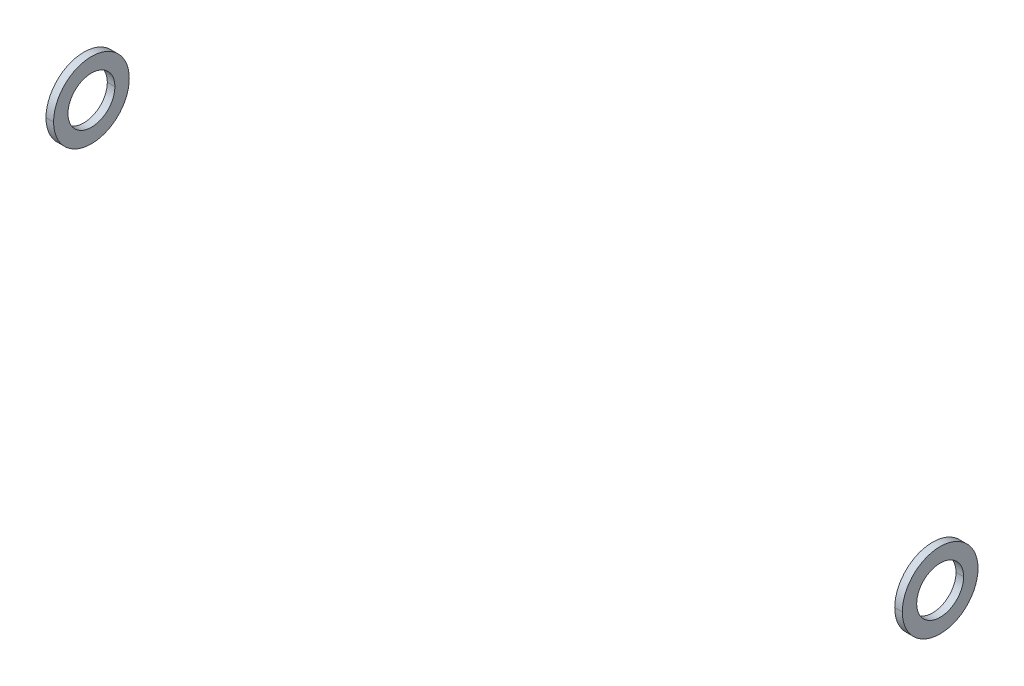
ISO-10303-21;
HEADER;
FILE_DESCRIPTION(('STEP AP214'),'2;1');
FILE_NAME('part.step','',(''),(''),'','','');
FILE_SCHEMA(('AUTOMOTIVE_DESIGN { 1 0 10303 214 1 1 1 1 }'));
ENDSEC;
DATA;
#1=APPLICATION_CONTEXT('core data for automotive mechanical design processes');
#2=APPLICATION_PROTOCOL_DEFINITION('international standard','automotive_design',2000,#1);
#3=PRODUCT_CONTEXT('',#1,'mechanical');
#4=PRODUCT('Part','Part','',(#3));
#5=PRODUCT_RELATED_PRODUCT_CATEGORY('part','',(#4));
#6=PRODUCT_DEFINITION_FORMATION('','',#4);
#7=PRODUCT_DEFINITION_CONTEXT('part definition',#1,'design');
#8=PRODUCT_DEFINITION('design','',#6,#7);
#9=PRODUCT_DEFINITION_SHAPE('','',#8);
#10=(LENGTH_UNIT() NAMED_UNIT(*) SI_UNIT(.MILLI.,.METRE.));
#11=(NAMED_UNIT(*) PLANE_ANGLE_UNIT() SI_UNIT($,.RADIAN.));
#12=(NAMED_UNIT(*) SI_UNIT($,.STERADIAN.) SOLID_ANGLE_UNIT());
#13=UNCERTAINTY_MEASURE_WITH_UNIT(LENGTH_MEASURE(1.E-05),#10,'distance_accuracy_value','');
#14=(GEOMETRIC_REPRESENTATION_CONTEXT(3) GLOBAL_UNCERTAINTY_ASSIGNED_CONTEXT((#13)) GLOBAL_UNIT_ASSIGNED_CONTEXT((#10,
#11,#12)) REPRESENTATION_CONTEXT('',''));
#15=CARTESIAN_POINT('',(0.,0.,0.));
#16=DIRECTION('',(0.,0.,1.));
#17=DIRECTION('',(1.,0.,0.));
#18=AXIS2_PLACEMENT_3D('',#15,#16,#17);
#19=CARTESIAN_POINT('',(120.272398751943,-122.5,-62.));
#20=DIRECTION('',(-1.,0.,0.));
#21=DIRECTION('',(0.,0.,-1.));
#22=AXIS2_PLACEMENT_3D('',#19,#20,#21);
#23=CYLINDRICAL_SURFACE('',#22,10.);
#24=DIRECTION('',(1.,0.,0.));
#25=VECTOR('',#24,1.);
#26=CARTESIAN_POINT('',(120.272398751943,-122.5,-72.));
#27=LINE('',#26,#25);
#28=CARTESIAN_POINT('',(119.272398751943,-122.5,-72.));
#29=VERTEX_POINT('',#28);
#30=CARTESIAN_POINT('',(121.272398751943,-122.5,-72.));
#31=VERTEX_POINT('',#30);
#32=EDGE_CURVE('P0_E11',#29,#31,#27,.T.);
#33=ORIENTED_EDGE('',*,*,#32,.T.);
#34=CARTESIAN_POINT('',(121.272398751943,-122.5,-62.));
#35=DIRECTION('',(-1.,0.,0.));
#36=DIRECTION('',(0.,0.,1.));
#37=AXIS2_PLACEMENT_3D('',#34,#35,#36);
#38=CIRCLE('',#37,10.);
#39=CARTESIAN_POINT('',(121.272398751943,-122.5,-52.));
#40=VERTEX_POINT('',#39);
#41=EDGE_CURVE('P0_E27',#31,#40,#38,.T.);
#42=ORIENTED_EDGE('',*,*,#41,.T.);
#43=DIRECTION('',(1.,0.,0.));
#44=VECTOR('',#43,1.);
#45=CARTESIAN_POINT('',(120.272398751943,-122.5,-52.));
#46=LINE('',#45,#44);
#47=CARTESIAN_POINT('',(119.272398751943,-122.5,-52.));
#48=VERTEX_POINT('',#47);
#49=EDGE_CURVE('P0_E179',#48,#40,#46,.T.);
#50=ORIENTED_EDGE('',*,*,#49,.F.);
#51=CARTESIAN_POINT('',(119.272398751943,-122.5,-62.));
#52=DIRECTION('',(-1.,0.,0.));
#53=DIRECTION('',(0.,0.,1.));
#54=AXIS2_PLACEMENT_3D('',#51,#52,#53);
#55=CIRCLE('',#54,10.);
#56=EDGE_CURVE('P0_E63',#29,#48,#55,.T.);
#57=ORIENTED_EDGE('',*,*,#56,.F.);
#58=EDGE_LOOP('',(#33,#42,#50,#57));
#59=FACE_BOUND('',#58,.T.);
#60=ADVANCED_FACE('P0_F17',(#59),#23,.T.);
#61=CARTESIAN_POINT('',(120.272398751943,-122.5,-62.));
#62=DIRECTION('',(-1.,0.,0.));
#63=DIRECTION('',(0.,0.,-1.));
#64=AXIS2_PLACEMENT_3D('',#61,#62,#63);
#65=CYLINDRICAL_SURFACE('',#64,10.);
#66=ORIENTED_EDGE('',*,*,#49,.T.);
#67=CARTESIAN_POINT('',(121.272398751943,-122.5,-62.));
#68=DIRECTION('',(-1.,0.,0.));
#69=DIRECTION('',(0.,0.,1.));
#70=AXIS2_PLACEMENT_3D('',#67,#68,#69);
#71=CIRCLE('',#70,10.);
#72=EDGE_CURVE('P0_E178',#40,#31,#71,.T.);
#73=ORIENTED_EDGE('',*,*,#72,.T.);
#74=ORIENTED_EDGE('',*,*,#32,.F.);
#75=CARTESIAN_POINT('',(119.272398751943,-122.5,-62.));
#76=DIRECTION('',(-1.,0.,0.));
#77=DIRECTION('',(0.,0.,1.));
#78=AXIS2_PLACEMENT_3D('',#75,#76,#77);
#79=CIRCLE('',#78,10.);
#80=EDGE_CURVE('P0_E186',#48,#29,#79,.T.);
#81=ORIENTED_EDGE('',*,*,#80,.F.);
#82=EDGE_LOOP('',(#66,#73,#74,#81));
#83=FACE_BOUND('',#82,.T.);
#84=ADVANCED_FACE('P0_F81',(#83),#65,.T.);
#85=CARTESIAN_POINT('',(120.272398751943,-122.5,-62.));
#86=DIRECTION('',(-1.,0.,0.));
#87=DIRECTION('',(0.,0.,-1.));
#88=AXIS2_PLACEMENT_3D('',#85,#86,#87);
#89=CYLINDRICAL_SURFACE('',#88,6.2);
#90=CARTESIAN_POINT('',(119.272398751943,-122.5,-62.));
#91=DIRECTION('',(-1.,0.,0.));
#92=DIRECTION('',(0.,0.,1.));
#93=AXIS2_PLACEMENT_3D('',#90,#91,#92);
#94=CIRCLE('',#93,6.2);
#95=CARTESIAN_POINT('',(119.272398751943,-122.5,-55.8));
#96=VERTEX_POINT('',#95);
#97=CARTESIAN_POINT('',(119.272398751943,-122.5,-68.2));
#98=VERTEX_POINT('',#97);
#99=EDGE_CURVE('P0_E180',#96,#98,#94,.T.);
#100=ORIENTED_EDGE('',*,*,#99,.T.);
#101=DIRECTION('',(1.,0.,0.));
#102=VECTOR('',#101,1.);
#103=CARTESIAN_POINT('',(120.272398751943,-122.5,-68.2));
#104=LINE('',#103,#102);
#105=CARTESIAN_POINT('',(121.272398751943,-122.5,-68.2));
#106=VERTEX_POINT('',#105);
#107=EDGE_CURVE('P0_E61',#98,#106,#104,.T.);
#108=ORIENTED_EDGE('',*,*,#107,.T.);
#109=CARTESIAN_POINT('',(121.272398751943,-122.5,-62.));
#110=DIRECTION('',(-1.,0.,0.));
#111=DIRECTION('',(0.,0.,1.));
#112=AXIS2_PLACEMENT_3D('',#109,#110,#111);
#113=CIRCLE('',#112,6.2);
#114=CARTESIAN_POINT('',(121.272398751943,-122.5,-55.8));
#115=VERTEX_POINT('',#114);
#116=EDGE_CURVE('P0_E53',#115,#106,#113,.T.);
#117=ORIENTED_EDGE('',*,*,#116,.F.);
#118=DIRECTION('',(1.,0.,0.));
#119=VECTOR('',#118,1.);
#120=CARTESIAN_POINT('',(120.272398751943,-122.5,-55.8));
#121=LINE('',#120,#119);
#122=EDGE_CURVE('P0_E59',#96,#115,#121,.T.);
#123=ORIENTED_EDGE('',*,*,#122,.F.);
#124=EDGE_LOOP('',(#100,#108,#117,#123));
#125=FACE_BOUND('',#124,.T.);
#126=ADVANCED_FACE('P0_F58',(#125),#89,.F.);
#127=CARTESIAN_POINT('',(120.272398751943,-122.5,-62.));
#128=DIRECTION('',(-1.,0.,0.));
#129=DIRECTION('',(0.,0.,-1.));
#130=AXIS2_PLACEMENT_3D('',#127,#128,#129);
#131=CYLINDRICAL_SURFACE('',#130,6.2);
#132=CARTESIAN_POINT('',(119.272398751943,-122.5,-62.));
#133=DIRECTION('',(-1.,0.,0.));
#134=DIRECTION('',(0.,0.,1.));
#135=AXIS2_PLACEMENT_3D('',#132,#133,#134);
#136=CIRCLE('',#135,6.2);
#137=EDGE_CURVE('P0_E69',#98,#96,#136,.T.);
#138=ORIENTED_EDGE('',*,*,#137,.T.);
#139=ORIENTED_EDGE('',*,*,#122,.T.);
#140=CARTESIAN_POINT('',(121.272398751943,-122.5,-62.));
#141=DIRECTION('',(-1.,0.,0.));
#142=DIRECTION('',(0.,0.,1.));
#143=AXIS2_PLACEMENT_3D('',#140,#141,#142);
#144=CIRCLE('',#143,6.2);
#145=EDGE_CURVE('P0_E21',#106,#115,#144,.T.);
#146=ORIENTED_EDGE('',*,*,#145,.F.);
#147=ORIENTED_EDGE('',*,*,#107,.F.);
#148=EDGE_LOOP('',(#138,#139,#146,#147));
#149=FACE_BOUND('',#148,.T.);
#150=ADVANCED_FACE('P0_F67',(#149),#131,.F.);
#151=CARTESIAN_POINT('',(121.272398751943,-122.5,-62.));
#152=DIRECTION('',(-1.,0.,0.));
#153=DIRECTION('',(0.,0.,1.));
#154=AXIS2_PLACEMENT_3D('',#151,#152,#153);
#155=PLANE('',#154);
#156=ORIENTED_EDGE('',*,*,#72,.F.);
#157=ORIENTED_EDGE('',*,*,#41,.F.);
#158=EDGE_LOOP('',(#156,#157));
#159=FACE_BOUND('',#158,.T.);
#160=ORIENTED_EDGE('',*,*,#145,.T.);
#161=ORIENTED_EDGE('',*,*,#116,.T.);
#162=EDGE_LOOP('',(#160,#161));
#163=FACE_BOUND('',#162,.T.);
#164=ADVANCED_FACE('P0_F71',(#159,#163),#155,.F.);
#165=CARTESIAN_POINT('',(119.272398751943,-122.5,-62.));
#166=DIRECTION('',(-1.,0.,0.));
#167=DIRECTION('',(0.,0.,1.));
#168=AXIS2_PLACEMENT_3D('',#165,#166,#167);
#169=PLANE('',#168);
#170=ORIENTED_EDGE('',*,*,#56,.T.);
#171=ORIENTED_EDGE('',*,*,#80,.T.);
#172=EDGE_LOOP('',(#170,#171));
#173=FACE_BOUND('',#172,.T.);
#174=ORIENTED_EDGE('',*,*,#99,.F.);
#175=ORIENTED_EDGE('',*,*,#137,.F.);
#176=EDGE_LOOP('',(#174,#175));
#177=FACE_BOUND('',#176,.T.);
#178=ADVANCED_FACE('P0_F19',(#173,#177),#169,.T.);
#179=CLOSED_SHELL('',(#60,#84,#126,#150,#164,#178));
#180=MANIFOLD_SOLID_BREP('P0_B1',#179);
#181=CARTESIAN_POINT('',(-104.,-122.5,-62.));
#182=DIRECTION('',(1.,0.,0.));
#183=DIRECTION('',(0.,0.,1.));
#184=AXIS2_PLACEMENT_3D('',#181,#182,#183);
#185=CYLINDRICAL_SURFACE('',#184,10.);
#186=DIRECTION('',(1.,0.,0.));
#187=VECTOR('',#186,1.);
#188=CARTESIAN_POINT('',(-104.,-122.5,-52.));
#189=LINE('',#188,#187);
#190=CARTESIAN_POINT('',(-105.,-122.5,-52.));
#191=VERTEX_POINT('',#190);
#192=CARTESIAN_POINT('',(-103.,-122.5,-52.));
#193=VERTEX_POINT('',#192);
#194=EDGE_CURVE('P1_E35',#191,#193,#189,.T.);
#195=ORIENTED_EDGE('',*,*,#194,.F.);
#196=CARTESIAN_POINT('',(-105.,-122.5,-62.));
#197=DIRECTION('',(1.,0.,0.));
#198=DIRECTION('',(0.,0.,-1.));
#199=AXIS2_PLACEMENT_3D('',#196,#197,#198);
#200=CIRCLE('',#199,10.);
#201=CARTESIAN_POINT('',(-105.,-122.5,-72.));
#202=VERTEX_POINT('',#201);
#203=EDGE_CURVE('P1_E11',#191,#202,#200,.T.);
#204=ORIENTED_EDGE('',*,*,#203,.T.);
#205=DIRECTION('',(1.,0.,0.));
#206=VECTOR('',#205,1.);
#207=CARTESIAN_POINT('',(-104.,-122.5,-72.));
#208=LINE('',#207,#206);
#209=CARTESIAN_POINT('',(-103.,-122.5,-72.));
#210=VERTEX_POINT('',#209);
#211=EDGE_CURVE('P1_E27',#202,#210,#208,.T.);
#212=ORIENTED_EDGE('',*,*,#211,.T.);
#213=CARTESIAN_POINT('',(-103.,-122.5,-62.));
#214=DIRECTION('',(1.,0.,0.));
#215=DIRECTION('',(0.,0.,-1.));
#216=AXIS2_PLACEMENT_3D('',#213,#214,#215);
#217=CIRCLE('',#216,10.);
#218=EDGE_CURVE('P1_E65',#193,#210,#217,.T.);
#219=ORIENTED_EDGE('',*,*,#218,.F.);
#220=EDGE_LOOP('',(#195,#204,#212,#219));
#221=FACE_BOUND('',#220,.T.);
#222=ADVANCED_FACE('P1_F17',(#221),#185,.T.);
#223=CARTESIAN_POINT('',(-104.,-122.5,-62.));
#224=DIRECTION('',(1.,0.,0.));
#225=DIRECTION('',(0.,0.,1.));
#226=AXIS2_PLACEMENT_3D('',#223,#224,#225);
#227=CYLINDRICAL_SURFACE('',#226,10.);
#228=ORIENTED_EDGE('',*,*,#211,.F.);
#229=CARTESIAN_POINT('',(-105.,-122.5,-62.));
#230=DIRECTION('',(1.,0.,0.));
#231=DIRECTION('',(0.,0.,-1.));
#232=AXIS2_PLACEMENT_3D('',#229,#230,#231);
#233=CIRCLE('',#232,10.);
#234=EDGE_CURVE('P1_E81',#202,#191,#233,.T.);
#235=ORIENTED_EDGE('',*,*,#234,.T.);
#236=ORIENTED_EDGE('',*,*,#194,.T.);
#237=CARTESIAN_POINT('',(-103.,-122.5,-62.));
#238=DIRECTION('',(1.,0.,0.));
#239=DIRECTION('',(0.,0.,-1.));
#240=AXIS2_PLACEMENT_3D('',#237,#238,#239);
#241=CIRCLE('',#240,10.);
#242=EDGE_CURVE('P1_E78',#210,#193,#241,.T.);
#243=ORIENTED_EDGE('',*,*,#242,.F.);
#244=EDGE_LOOP('',(#228,#235,#236,#243));
#245=FACE_BOUND('',#244,.T.);
#246=ADVANCED_FACE('P1_F89',(#245),#227,.T.);
#247=CARTESIAN_POINT('',(-104.,-122.5,-62.));
#248=DIRECTION('',(1.,0.,0.));
#249=DIRECTION('',(0.,0.,1.));
#250=AXIS2_PLACEMENT_3D('',#247,#248,#249);
#251=CYLINDRICAL_SURFACE('',#250,6.2);
#252=CARTESIAN_POINT('',(-103.,-122.5,-62.));
#253=DIRECTION('',(1.,0.,0.));
#254=DIRECTION('',(0.,0.,-1.));
#255=AXIS2_PLACEMENT_3D('',#252,#253,#254);
#256=CIRCLE('',#255,6.2);
#257=CARTESIAN_POINT('',(-103.,-122.5,-68.2));
#258=VERTEX_POINT('',#257);
#259=CARTESIAN_POINT('',(-103.,-122.5,-55.8));
#260=VERTEX_POINT('',#259);
#261=EDGE_CURVE('P1_E72',#258,#260,#256,.T.);
#262=ORIENTED_EDGE('',*,*,#261,.T.);
#263=DIRECTION('',(1.,0.,0.));
#264=VECTOR('',#263,1.);
#265=CARTESIAN_POINT('',(-104.,-122.5,-55.8));
#266=LINE('',#265,#264);
#267=CARTESIAN_POINT('',(-105.,-122.5,-55.8));
#268=VERTEX_POINT('',#267);
#269=EDGE_CURVE('P1_E63',#268,#260,#266,.T.);
#270=ORIENTED_EDGE('',*,*,#269,.F.);
#271=CARTESIAN_POINT('',(-105.,-122.5,-62.));
#272=DIRECTION('',(1.,0.,0.));
#273=DIRECTION('',(0.,0.,-1.));
#274=AXIS2_PLACEMENT_3D('',#271,#272,#273);
#275=CIRCLE('',#274,6.2);
#276=CARTESIAN_POINT('',(-105.,-122.5,-68.2));
#277=VERTEX_POINT('',#276);
#278=EDGE_CURVE('P1_E55',#277,#268,#275,.T.);
#279=ORIENTED_EDGE('',*,*,#278,.F.);
#280=DIRECTION('',(1.,0.,0.));
#281=VECTOR('',#280,1.);
#282=CARTESIAN_POINT('',(-104.,-122.5,-68.2));
#283=LINE('',#282,#281);
#284=EDGE_CURVE('P1_E61',#277,#258,#283,.T.);
#285=ORIENTED_EDGE('',*,*,#284,.T.);
#286=EDGE_LOOP('',(#262,#270,#279,#285));
#287=FACE_BOUND('',#286,.T.);
#288=ADVANCED_FACE('P1_F60',(#287),#251,.F.);
#289=CARTESIAN_POINT('',(-104.,-122.5,-62.));
#290=DIRECTION('',(1.,0.,0.));
#291=DIRECTION('',(0.,0.,1.));
#292=AXIS2_PLACEMENT_3D('',#289,#290,#291);
#293=CYLINDRICAL_SURFACE('',#292,6.2);
#294=CARTESIAN_POINT('',(-103.,-122.5,-62.));
#295=DIRECTION('',(1.,0.,0.));
#296=DIRECTION('',(0.,0.,-1.));
#297=AXIS2_PLACEMENT_3D('',#294,#295,#296);
#298=CIRCLE('',#297,6.2);
#299=EDGE_CURVE('P1_E71',#260,#258,#298,.T.);
#300=ORIENTED_EDGE('',*,*,#299,.T.);
#301=ORIENTED_EDGE('',*,*,#284,.F.);
#302=CARTESIAN_POINT('',(-105.,-122.5,-62.));
#303=DIRECTION('',(1.,0.,0.));
#304=DIRECTION('',(0.,0.,-1.));
#305=AXIS2_PLACEMENT_3D('',#302,#303,#304);
#306=CIRCLE('',#305,6.2);
#307=EDGE_CURVE('P1_E21',#268,#277,#306,.T.);
#308=ORIENTED_EDGE('',*,*,#307,.F.);
#309=ORIENTED_EDGE('',*,*,#269,.T.);
#310=EDGE_LOOP('',(#300,#301,#308,#309));
#311=FACE_BOUND('',#310,.T.);
#312=ADVANCED_FACE('P1_F69',(#311),#293,.F.);
#313=CARTESIAN_POINT('',(-105.,-122.5,-62.));
#314=DIRECTION('',(1.,0.,0.));
#315=DIRECTION('',(0.,0.,-1.));
#316=AXIS2_PLACEMENT_3D('',#313,#314,#315);
#317=PLANE('',#316);
#318=ORIENTED_EDGE('',*,*,#234,.F.);
#319=ORIENTED_EDGE('',*,*,#203,.F.);
#320=EDGE_LOOP('',(#318,#319));
#321=FACE_BOUND('',#320,.T.);
#322=ORIENTED_EDGE('',*,*,#307,.T.);
#323=ORIENTED_EDGE('',*,*,#278,.T.);
#324=EDGE_LOOP('',(#322,#323));
#325=FACE_BOUND('',#324,.T.);
#326=ADVANCED_FACE('P1_F74',(#321,#325),#317,.F.);
#327=CARTESIAN_POINT('',(-103.,-122.5,-62.));
#328=DIRECTION('',(1.,0.,0.));
#329=DIRECTION('',(0.,0.,-1.));
#330=AXIS2_PLACEMENT_3D('',#327,#328,#329);
#331=PLANE('',#330);
#332=ORIENTED_EDGE('',*,*,#218,.T.);
#333=ORIENTED_EDGE('',*,*,#242,.T.);
#334=EDGE_LOOP('',(#332,#333));
#335=FACE_BOUND('',#334,.T.);
#336=ORIENTED_EDGE('',*,*,#261,.F.);
#337=ORIENTED_EDGE('',*,*,#299,.F.);
#338=EDGE_LOOP('',(#336,#337));
#339=FACE_BOUND('',#338,.T.);
#340=ADVANCED_FACE('P1_F19',(#335,#339),#331,.T.);
#341=CLOSED_SHELL('',(#222,#246,#288,#312,#326,#340));
#342=MANIFOLD_SOLID_BREP('P1_B1',#341);
#343=ADVANCED_BREP_SHAPE_REPRESENTATION('',(#18,#180,#342),#14);
#344=SHAPE_DEFINITION_REPRESENTATION(#9,#343);
ENDSEC;
END-ISO-10303-21;
